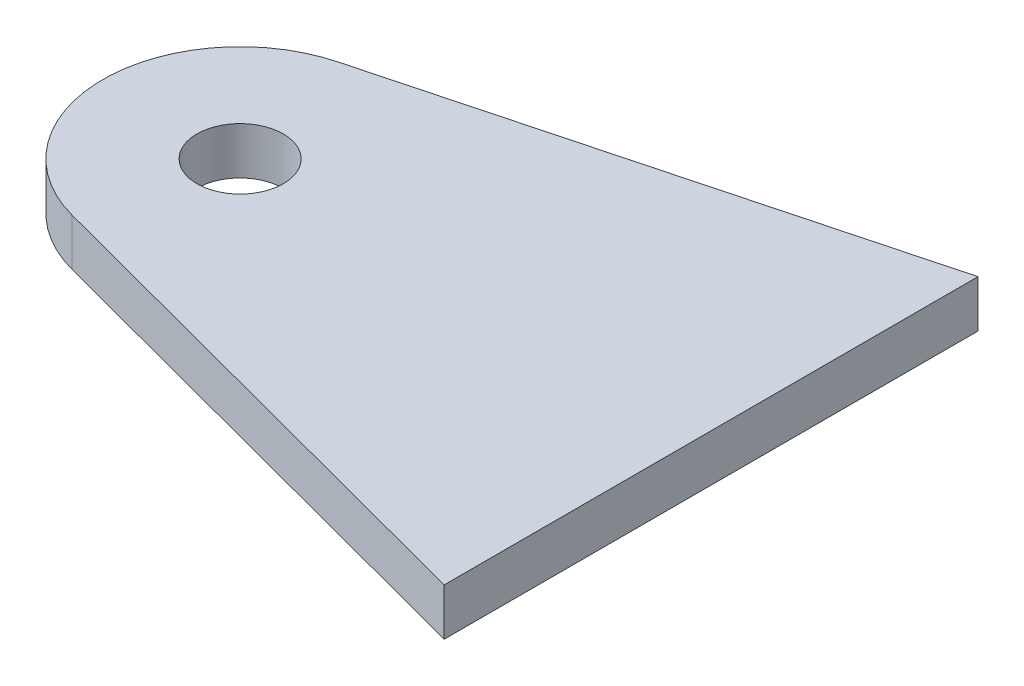
ISO-10303-21;
HEADER;
FILE_DESCRIPTION(('STEP AP214'),'2;1');
FILE_NAME('part.step','',(''),(''),'','','');
FILE_SCHEMA(('AUTOMOTIVE_DESIGN { 1 0 10303 214 1 1 1 1 }'));
ENDSEC;
DATA;
#1=APPLICATION_CONTEXT('core data for automotive mechanical design processes');
#2=APPLICATION_PROTOCOL_DEFINITION('international standard','automotive_design',2000,#1);
#3=PRODUCT_CONTEXT('',#1,'mechanical');
#4=PRODUCT('Part','Part','',(#3));
#5=PRODUCT_RELATED_PRODUCT_CATEGORY('part','',(#4));
#6=PRODUCT_DEFINITION_FORMATION('','',#4);
#7=PRODUCT_DEFINITION_CONTEXT('part definition',#1,'design');
#8=PRODUCT_DEFINITION('design','',#6,#7);
#9=PRODUCT_DEFINITION_SHAPE('','',#8);
#10=(LENGTH_UNIT() NAMED_UNIT(*) SI_UNIT(.MILLI.,.METRE.));
#11=(NAMED_UNIT(*) PLANE_ANGLE_UNIT() SI_UNIT($,.RADIAN.));
#12=(NAMED_UNIT(*) SI_UNIT($,.STERADIAN.) SOLID_ANGLE_UNIT());
#13=UNCERTAINTY_MEASURE_WITH_UNIT(LENGTH_MEASURE(1.E-05),#10,'distance_accuracy_value','');
#14=(GEOMETRIC_REPRESENTATION_CONTEXT(3) GLOBAL_UNCERTAINTY_ASSIGNED_CONTEXT((#13)) GLOBAL_UNIT_ASSIGNED_CONTEXT((#10,
#11,#12)) REPRESENTATION_CONTEXT('',''));
#15=CARTESIAN_POINT('',(0.,0.,0.));
#16=DIRECTION('',(0.,0.,1.));
#17=DIRECTION('',(1.,0.,0.));
#18=AXIS2_PLACEMENT_3D('',#15,#16,#17);
#19=CARTESIAN_POINT('',(646.000000000014,1657.70171432474,0.0129361289969208));
#20=DIRECTION('',(0.,-0.999999999969489,-7.8116640125623E-06));
#21=DIRECTION('',(0.,7.8116640125623E-06,-0.999999999969489));
#22=AXIS2_PLACEMENT_3D('',#19,#20,#21);
#23=PLANE('',#22);
#24=DIRECTION('',(-0.966649871304404,2.0005796106242E-06,-0.256101593714635));
#25=VECTOR('',#24,1.);
#26=CARTESIAN_POINT('',(706.000000000014,1657.70144872816,34.0129361269222));
#27=LINE('',#26,#25);
#28=CARTESIAN_POINT('',(706.000000000014,1657.70144872816,34.0129361269222));
#29=VERTEX_POINT('',#28);
#30=CARTESIAN_POINT('',(641.518222109872,1657.70158217972,16.9293088763079));
#31=VERTEX_POINT('',#30);
#32=EDGE_CURVE('E125',#29,#31,#27,.T.);
#33=ORIENTED_EDGE('',*,*,#32,.T.);
#34=CARTESIAN_POINT('',(646.000000000014,1657.70171432474,0.0129361289969208));
#35=DIRECTION('',(0.,-0.999999999969489,-7.8116640125623E-06));
#36=DIRECTION('',(0.,7.8116640125623E-06,-0.999999999969489));
#37=AXIS2_PLACEMENT_3D('',#34,#35,#36);
#38=CIRCLE('',#37,17.5);
#39=CARTESIAN_POINT('',(641.518222109872,1657.70184646976,-16.903436618314));
#40=VERTEX_POINT('',#39);
#41=EDGE_CURVE('E99',#31,#40,#38,.T.);
#42=ORIENTED_EDGE('',*,*,#41,.T.);
#43=DIRECTION('',(0.966649871304404,2.00057959730947E-06,-0.256101593714635));
#44=VECTOR('',#43,1.);
#45=CARTESIAN_POINT('',(706.000000000014,1657.70197992132,-33.9870638689283));
#46=LINE('',#45,#44);
#47=CARTESIAN_POINT('',(706.000000000014,1657.70197992132,-33.9870638689283));
#48=VERTEX_POINT('',#47);
#49=EDGE_CURVE('E75',#40,#48,#46,.T.);
#50=ORIENTED_EDGE('',*,*,#49,.T.);
#51=DIRECTION('',(0.,-7.81166401196439E-06,0.999999999969489));
#52=VECTOR('',#51,1.);
#53=CARTESIAN_POINT('',(706.000000000014,1657.70144872816,34.0129361269222));
#54=LINE('',#53,#52);
#55=EDGE_CURVE('E70',#48,#29,#54,.T.);
#56=ORIENTED_EDGE('',*,*,#55,.T.);
#57=EDGE_LOOP('',(#33,#42,#50,#56));
#58=FACE_BOUND('',#57,.T.);
#59=CARTESIAN_POINT('',(646.000000000014,1657.70171432474,0.0129361289969208));
#60=DIRECTION('',(0.,-0.999999999969489,-7.8116640125623E-06));
#61=DIRECTION('',(0.,7.8116640125623E-06,-0.999999999969489));
#62=AXIS2_PLACEMENT_3D('',#59,#60,#61);
#63=CIRCLE('',#62,5.49999999999996);
#64=CARTESIAN_POINT('',(646.000000000014,1657.70175728889,-5.48706387083523));
#65=VERTEX_POINT('',#64);
#66=EDGE_CURVE('E122',#65,#65,#63,.T.);
#67=ORIENTED_EDGE('',*,*,#66,.F.);
#68=EDGE_LOOP('',(#67));
#69=FACE_BOUND('',#68,.T.);
#70=ADVANCED_FACE('F55',(#58,#69),#23,.T.);
#71=CARTESIAN_POINT('',(706.000000000014,1657.70144872816,34.0129361269222));
#72=DIRECTION('',(0.256101593722449,7.55114401024077E-06,-0.966649871274911));
#73=DIRECTION('',(-0.96664987130247,0.,-0.256101593729751));
#74=AXIS2_PLACEMENT_3D('',#71,#72,#73);
#75=PLANE('',#74);
#76=DIRECTION('',(0.,0.999999999969489,7.8116640125623E-06));
#77=VECTOR('',#76,1.);
#78=CARTESIAN_POINT('',(706.000000000014,1657.70144872816,34.0129361269222));
#79=LINE('',#78,#77);
#80=CARTESIAN_POINT('',(706.000000000014,1663.70144872798,34.0129829969063));
#81=VERTEX_POINT('',#80);
#82=EDGE_CURVE('E113',#29,#81,#79,.T.);
#83=ORIENTED_EDGE('',*,*,#82,.T.);
#84=DIRECTION('',(-0.966649871304404,2.0005796106242E-06,-0.256101593714635));
#85=VECTOR('',#84,1.);
#86=CARTESIAN_POINT('',(706.000000000014,1663.70144872798,34.0129829969063));
#87=LINE('',#86,#85);
#88=CARTESIAN_POINT('',(641.518222109872,1663.70158217954,16.929355746292));
#89=VERTEX_POINT('',#88);
#90=EDGE_CURVE('E108',#81,#89,#87,.T.);
#91=ORIENTED_EDGE('',*,*,#90,.T.);
#92=DIRECTION('',(0.,0.999999999969489,7.8116640125623E-06));
#93=VECTOR('',#92,1.);
#94=CARTESIAN_POINT('',(641.518222109872,1657.70158217972,16.9293088763079));
#95=LINE('',#94,#93);
#96=EDGE_CURVE('E13',#31,#89,#95,.T.);
#97=ORIENTED_EDGE('',*,*,#96,.F.);
#98=ORIENTED_EDGE('',*,*,#32,.F.);
#99=EDGE_LOOP('',(#83,#91,#97,#98));
#100=FACE_BOUND('',#99,.T.);
#101=ADVANCED_FACE('F57',(#100),#75,.F.);
#102=CARTESIAN_POINT('',(646.000000000014,1657.70171432474,0.0129361289969208));
#103=DIRECTION('',(0.,0.999999999969489,7.8116640125623E-06));
#104=DIRECTION('',(0.,-7.8116640125623E-06,0.999999999969489));
#105=AXIS2_PLACEMENT_3D('',#102,#103,#104);
#106=CYLINDRICAL_SURFACE('',#105,17.5);
#107=ORIENTED_EDGE('',*,*,#96,.T.);
#108=CARTESIAN_POINT('',(646.000000000014,1663.70171432456,0.0129829989809962));
#109=DIRECTION('',(0.,-0.999999999969489,-7.8116640125623E-06));
#110=DIRECTION('',(0.,7.8116640125623E-06,-0.999999999969489));
#111=AXIS2_PLACEMENT_3D('',#108,#109,#110);
#112=CIRCLE('',#111,17.5);
#113=CARTESIAN_POINT('',(641.518222109872,1663.70184646958,-16.90338974833));
#114=VERTEX_POINT('',#113);
#115=EDGE_CURVE('E98',#89,#114,#112,.T.);
#116=ORIENTED_EDGE('',*,*,#115,.T.);
#117=DIRECTION('',(0.,0.999999999969489,7.8116640125623E-06));
#118=VECTOR('',#117,1.);
#119=CARTESIAN_POINT('',(641.518222109872,1657.70184646976,-16.903436618314));
#120=LINE('',#119,#118);
#121=EDGE_CURVE('E63',#40,#114,#120,.T.);
#122=ORIENTED_EDGE('',*,*,#121,.F.);
#123=ORIENTED_EDGE('',*,*,#41,.F.);
#124=EDGE_LOOP('',(#107,#116,#122,#123));
#125=FACE_BOUND('',#124,.T.);
#126=ADVANCED_FACE('F96',(#125),#106,.T.);
#127=CARTESIAN_POINT('',(706.000000000014,1657.70197992132,-33.9870638689283));
#128=DIRECTION('',(0.256101593722449,-7.55114401459243E-06,0.966649871274911));
#129=DIRECTION('',(0.96664987130247,0.,-0.256101593729751));
#130=AXIS2_PLACEMENT_3D('',#127,#128,#129);
#131=PLANE('',#130);
#132=ORIENTED_EDGE('',*,*,#121,.T.);
#133=DIRECTION('',(0.966649871304404,2.00057959730947E-06,-0.256101593714635));
#134=VECTOR('',#133,1.);
#135=CARTESIAN_POINT('',(706.000000000014,1663.70197992113,-33.9870169989443));
#136=LINE('',#135,#134);
#137=CARTESIAN_POINT('',(706.000000000014,1663.70197992113,-33.9870169989443));
#138=VERTEX_POINT('',#137);
#139=EDGE_CURVE('E111',#114,#138,#136,.T.);
#140=ORIENTED_EDGE('',*,*,#139,.T.);
#141=DIRECTION('',(0.,0.999999999969489,7.8116640125623E-06));
#142=VECTOR('',#141,1.);
#143=CARTESIAN_POINT('',(706.000000000014,1657.70197992132,-33.9870638689283));
#144=LINE('',#143,#142);
#145=EDGE_CURVE('E131',#48,#138,#144,.T.);
#146=ORIENTED_EDGE('',*,*,#145,.F.);
#147=ORIENTED_EDGE('',*,*,#49,.F.);
#148=EDGE_LOOP('',(#132,#140,#146,#147));
#149=FACE_BOUND('',#148,.T.);
#150=ADVANCED_FACE('F133',(#149),#131,.F.);
#151=CARTESIAN_POINT('',(706.000000000014,1657.70144872816,34.0129361269222));
#152=DIRECTION('',(-1.,0.,0.));
#153=DIRECTION('',(0.,-1.,0.));
#154=AXIS2_PLACEMENT_3D('',#151,#152,#153);
#155=PLANE('',#154);
#156=ORIENTED_EDGE('',*,*,#145,.T.);
#157=DIRECTION('',(0.,-7.81166401196439E-06,0.999999999969489));
#158=VECTOR('',#157,1.);
#159=CARTESIAN_POINT('',(706.000000000014,1663.70144872798,34.0129829969063));
#160=LINE('',#159,#158);
#161=EDGE_CURVE('E120',#138,#81,#160,.T.);
#162=ORIENTED_EDGE('',*,*,#161,.T.);
#163=ORIENTED_EDGE('',*,*,#82,.F.);
#164=ORIENTED_EDGE('',*,*,#55,.F.);
#165=EDGE_LOOP('',(#156,#162,#163,#164));
#166=FACE_BOUND('',#165,.T.);
#167=ADVANCED_FACE('F135',(#166),#155,.F.);
#168=CARTESIAN_POINT('',(646.000000000014,1657.70171432474,0.0129361289969208));
#169=DIRECTION('',(0.,0.999999999969489,7.8116640125623E-06));
#170=DIRECTION('',(0.,-7.8116640125623E-06,0.999999999969489));
#171=AXIS2_PLACEMENT_3D('',#168,#169,#170);
#172=CYLINDRICAL_SURFACE('',#171,5.49999999999996);
#173=ORIENTED_EDGE('',*,*,#66,.T.);
#174=EDGE_LOOP('',(#173));
#175=FACE_BOUND('',#174,.T.);
#176=CARTESIAN_POINT('',(646.000000000014,1663.70171432456,0.0129829989809962));
#177=DIRECTION('',(0.,-0.999999999969489,-7.8116640125623E-06));
#178=DIRECTION('',(0.,7.8116640125623E-06,-0.999999999969489));
#179=AXIS2_PLACEMENT_3D('',#176,#177,#178);
#180=CIRCLE('',#179,5.49999999999996);
#181=CARTESIAN_POINT('',(646.000000000014,1663.70175728871,-5.48701700085115));
#182=VERTEX_POINT('',#181);
#183=EDGE_CURVE('E114',#182,#182,#180,.T.);
#184=ORIENTED_EDGE('',*,*,#183,.F.);
#185=EDGE_LOOP('',(#184));
#186=FACE_BOUND('',#185,.T.);
#187=ADVANCED_FACE('F141',(#175,#186),#172,.F.);
#188=CARTESIAN_POINT('',(646.000000000014,1663.70171432456,0.0129829989809962));
#189=DIRECTION('',(0.,-0.999999999969489,-7.8116640125623E-06));
#190=DIRECTION('',(0.,7.8116640125623E-06,-0.999999999969489));
#191=AXIS2_PLACEMENT_3D('',#188,#189,#190);
#192=PLANE('',#191);
#193=ORIENTED_EDGE('',*,*,#183,.T.);
#194=EDGE_LOOP('',(#193));
#195=FACE_BOUND('',#194,.T.);
#196=ORIENTED_EDGE('',*,*,#90,.F.);
#197=ORIENTED_EDGE('',*,*,#161,.F.);
#198=ORIENTED_EDGE('',*,*,#139,.F.);
#199=ORIENTED_EDGE('',*,*,#115,.F.);
#200=EDGE_LOOP('',(#196,#197,#198,#199));
#201=FACE_BOUND('',#200,.T.);
#202=ADVANCED_FACE('F106',(#195,#201),#192,.F.);
#203=CLOSED_SHELL('',(#70,#101,#126,#150,#167,#187,#202));
#204=MANIFOLD_SOLID_BREP('B2',#203);
#205=ADVANCED_BREP_SHAPE_REPRESENTATION('',(#18,#204),#14);
#206=SHAPE_DEFINITION_REPRESENTATION(#9,#205);
ENDSEC;
END-ISO-10303-21;
